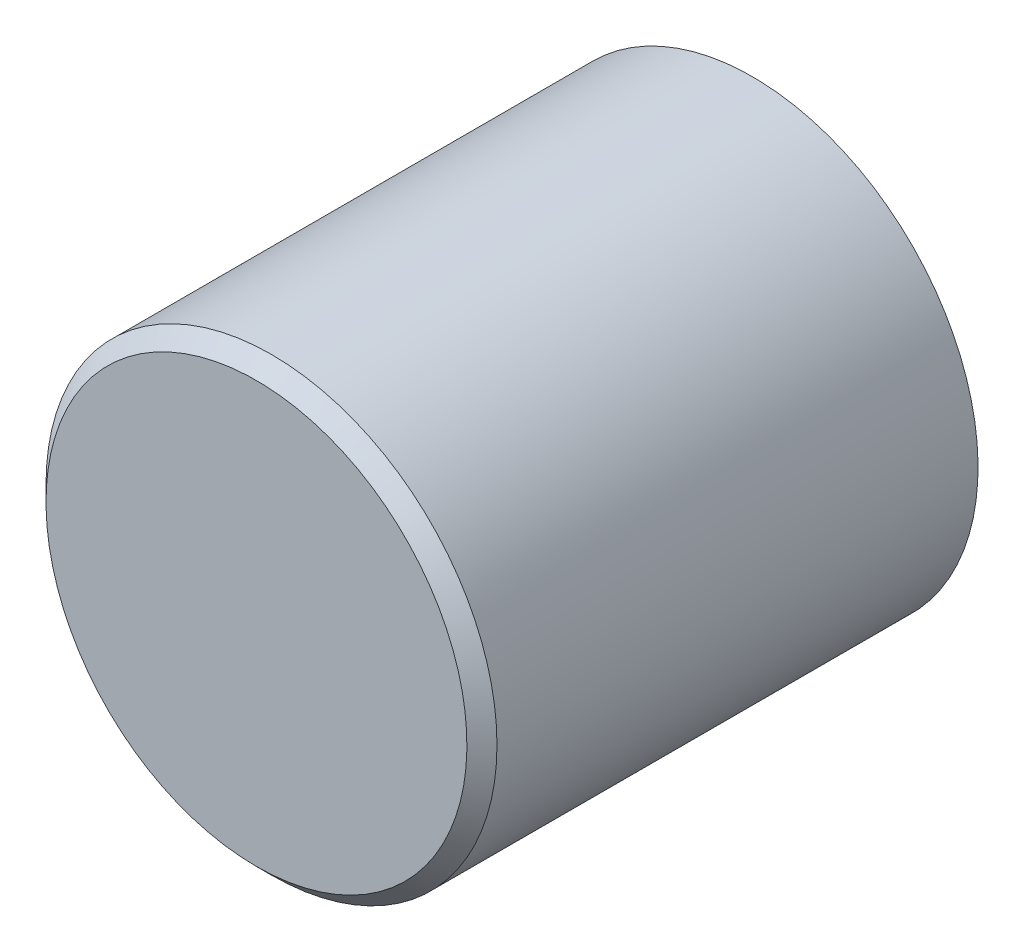
ISO-10303-21;
HEADER;
FILE_DESCRIPTION(('STEP AP214'),'2;1');
FILE_NAME('part.step','',(''),(''),'','','');
FILE_SCHEMA(('AUTOMOTIVE_DESIGN { 1 0 10303 214 1 1 1 1 }'));
ENDSEC;
DATA;
#1=APPLICATION_CONTEXT('core data for automotive mechanical design processes');
#2=APPLICATION_PROTOCOL_DEFINITION('international standard','automotive_design',2000,#1);
#3=PRODUCT_CONTEXT('',#1,'mechanical');
#4=PRODUCT('Part','Part','',(#3));
#5=PRODUCT_RELATED_PRODUCT_CATEGORY('part','',(#4));
#6=PRODUCT_DEFINITION_FORMATION('','',#4);
#7=PRODUCT_DEFINITION_CONTEXT('part definition',#1,'design');
#8=PRODUCT_DEFINITION('design','',#6,#7);
#9=PRODUCT_DEFINITION_SHAPE('','',#8);
#10=(LENGTH_UNIT() NAMED_UNIT(*) SI_UNIT(.MILLI.,.METRE.));
#11=(NAMED_UNIT(*) PLANE_ANGLE_UNIT() SI_UNIT($,.RADIAN.));
#12=(NAMED_UNIT(*) SI_UNIT($,.STERADIAN.) SOLID_ANGLE_UNIT());
#13=UNCERTAINTY_MEASURE_WITH_UNIT(LENGTH_MEASURE(1.E-05),#10,'distance_accuracy_value','');
#14=(GEOMETRIC_REPRESENTATION_CONTEXT(3) GLOBAL_UNCERTAINTY_ASSIGNED_CONTEXT((#13)) GLOBAL_UNIT_ASSIGNED_CONTEXT((#10,
#11,#12)) REPRESENTATION_CONTEXT('',''));
#15=CARTESIAN_POINT('',(0.,0.,0.));
#16=DIRECTION('',(0.,0.,1.));
#17=DIRECTION('',(1.,0.,0.));
#18=AXIS2_PLACEMENT_3D('',#15,#16,#17);
#19=CARTESIAN_POINT('',(6.77630717234365,8.00164803379831,25.375));
#20=DIRECTION('',(0.,0.,-1.));
#21=DIRECTION('',(-1.,0.,0.));
#22=AXIS2_PLACEMENT_3D('',#19,#20,#21);
#23=CYLINDRICAL_SURFACE('',#22,3.);
#24=CARTESIAN_POINT('',(6.77630717234365,8.00164803379831,8.87499999999997));
#25=DIRECTION('',(0.,-4.37114089995349E-08,0.999999999999999));
#26=DIRECTION('',(0.,-0.999999999999999,-4.37114089995349E-08));
#27=AXIS2_PLACEMENT_3D('',#24,#25,#26);
#28=CIRCLE('',#27,3.);
#29=CARTESIAN_POINT('',(6.77630717234365,5.00164803379832,8.87499986886574));
#30=VERTEX_POINT('',#29);
#31=EDGE_CURVE('E60',#30,#30,#28,.T.);
#32=ORIENTED_EDGE('',*,*,#31,.F.);
#33=EDGE_LOOP('',(#32));
#34=FACE_BOUND('',#33,.T.);
#35=CARTESIAN_POINT('',(6.77630717234365,8.00164803379831,24.375));
#36=DIRECTION('',(0.,-4.37114089995349E-08,0.999999999999999));
#37=DIRECTION('',(0.,-0.999999999999999,-4.37114089995349E-08));
#38=AXIS2_PLACEMENT_3D('',#35,#36,#37);
#39=CIRCLE('',#38,3.);
#40=CARTESIAN_POINT('',(6.77630717234365,5.00164803379832,24.3749998688657));
#41=VERTEX_POINT('',#40);
#42=EDGE_CURVE('E65',#41,#41,#39,.T.);
#43=ORIENTED_EDGE('',*,*,#42,.T.);
#44=EDGE_LOOP('',(#43));
#45=FACE_BOUND('',#44,.T.);
#46=ADVANCED_FACE('F44',(#34,#45),#23,.F.);
#47=CARTESIAN_POINT('',(6.77630717234365,8.00164803379135,25.375));
#48=DIRECTION('',(0.,-4.37114089995349E-08,0.999999999999999));
#49=DIRECTION('',(0.,-0.999999999999999,-4.37114089995349E-08));
#50=AXIS2_PLACEMENT_3D('',#47,#48,#49);
#51=PLANE('',#50);
#52=CARTESIAN_POINT('',(6.77630717234365,8.00164803379136,25.375));
#53=DIRECTION('',(0.,-4.37114089995349E-08,0.999999999999999));
#54=DIRECTION('',(0.,-0.999999999999999,-4.37114089995349E-08));
#55=AXIS2_PLACEMENT_3D('',#52,#53,#54);
#56=CIRCLE('',#55,7.00000032783557);
#57=CARTESIAN_POINT('',(6.77630717234365,1.00164770595579,25.3749996940201));
#58=VERTEX_POINT('',#57);
#59=EDGE_CURVE('E52',#58,#58,#56,.T.);
#60=ORIENTED_EDGE('',*,*,#59,.T.);
#61=EDGE_LOOP('',(#60));
#62=FACE_BOUND('',#61,.T.);
#63=ADVANCED_FACE('F82',(#62),#51,.T.);
#64=CARTESIAN_POINT('',(6.77630717234365,8.00164803379135,8.87499999999997));
#65=DIRECTION('',(0.,-4.37114089995349E-08,0.999999999999999));
#66=DIRECTION('',(0.,-0.999999999999999,-4.37114089995349E-08));
#67=AXIS2_PLACEMENT_3D('',#64,#65,#66);
#68=PLANE('',#67);
#69=CARTESIAN_POINT('',(6.77630717234365,8.00164803379135,8.87499999999997));
#70=DIRECTION('',(0.,-4.37114089995349E-08,0.999999999999999));
#71=DIRECTION('',(0.,-0.999999999999999,-4.37114089995349E-08));
#72=AXIS2_PLACEMENT_3D('',#69,#70,#71);
#73=CIRCLE('',#72,7.5);
#74=CARTESIAN_POINT('',(6.77630717234365,0.501648033791354,8.8749996721644));
#75=VERTEX_POINT('',#74);
#76=EDGE_CURVE('E56',#75,#75,#73,.T.);
#77=ORIENTED_EDGE('',*,*,#76,.F.);
#78=EDGE_LOOP('',(#77));
#79=FACE_BOUND('',#78,.T.);
#80=ORIENTED_EDGE('',*,*,#31,.T.);
#81=EDGE_LOOP('',(#80));
#82=FACE_BOUND('',#81,.T.);
#83=ADVANCED_FACE('F79',(#79,#82),#68,.F.);
#84=CARTESIAN_POINT('',(6.77630717234365,8.00164803379135,25.375));
#85=DIRECTION('',(0.,0.,-1.));
#86=DIRECTION('',(-1.,0.,0.));
#87=AXIS2_PLACEMENT_3D('',#84,#85,#86);
#88=CYLINDRICAL_SURFACE('',#87,7.5);
#89=CARTESIAN_POINT('',(6.77630717234365,8.00164803379135,24.875));
#90=DIRECTION('',(0.,0.,1.));
#91=DIRECTION('',(1.,0.,0.));
#92=AXIS2_PLACEMENT_3D('',#89,#90,#91);
#93=CIRCLE('',#92,7.5);
#94=CARTESIAN_POINT('',(14.2763071723436,8.00164803379135,24.875));
#95=VERTEX_POINT('',#94);
#96=EDGE_CURVE('E11',#95,#95,#93,.F.);
#97=ORIENTED_EDGE('',*,*,#96,.T.);
#98=EDGE_LOOP('',(#97));
#99=FACE_BOUND('',#98,.T.);
#100=ORIENTED_EDGE('',*,*,#76,.T.);
#101=EDGE_LOOP('',(#100));
#102=FACE_BOUND('',#101,.T.);
#103=ADVANCED_FACE('F72',(#99,#102),#88,.T.);
#104=CARTESIAN_POINT('',(6.77630717234365,8.00164803379831,24.375));
#105=DIRECTION('',(0.,-4.37114089995349E-08,0.999999999999999));
#106=DIRECTION('',(0.,-0.999999999999999,-4.37114089995349E-08));
#107=AXIS2_PLACEMENT_3D('',#104,#105,#106);
#108=PLANE('',#107);
#109=ORIENTED_EDGE('',*,*,#42,.F.);
#110=EDGE_LOOP('',(#109));
#111=FACE_BOUND('',#110,.T.);
#112=ADVANCED_FACE('F70',(#111),#108,.F.);
#113=CARTESIAN_POINT('',(6.77630717234365,8.00164803379135,25.375));
#114=DIRECTION('',(0.,0.,-1.));
#115=DIRECTION('',(-1.,0.,0.));
#116=AXIS2_PLACEMENT_3D('',#113,#114,#115);
#117=CONICAL_SURFACE('',#116,7.00000002185569,0.785398141541736);
#118=ORIENTED_EDGE('',*,*,#96,.F.);
#119=EDGE_LOOP('',(#118));
#120=FACE_BOUND('',#119,.T.);
#121=ORIENTED_EDGE('',*,*,#59,.F.);
#122=EDGE_LOOP('',(#121));
#123=FACE_BOUND('',#122,.T.);
#124=ADVANCED_FACE('F47',(#120,#123),#117,.T.);
#125=CLOSED_SHELL('',(#46,#63,#83,#103,#112,#124));
#126=MANIFOLD_SOLID_BREP('B2',#125);
#127=ADVANCED_BREP_SHAPE_REPRESENTATION('',(#18,#126),#14);
#128=SHAPE_DEFINITION_REPRESENTATION(#9,#127);
ENDSEC;
END-ISO-10303-21;
